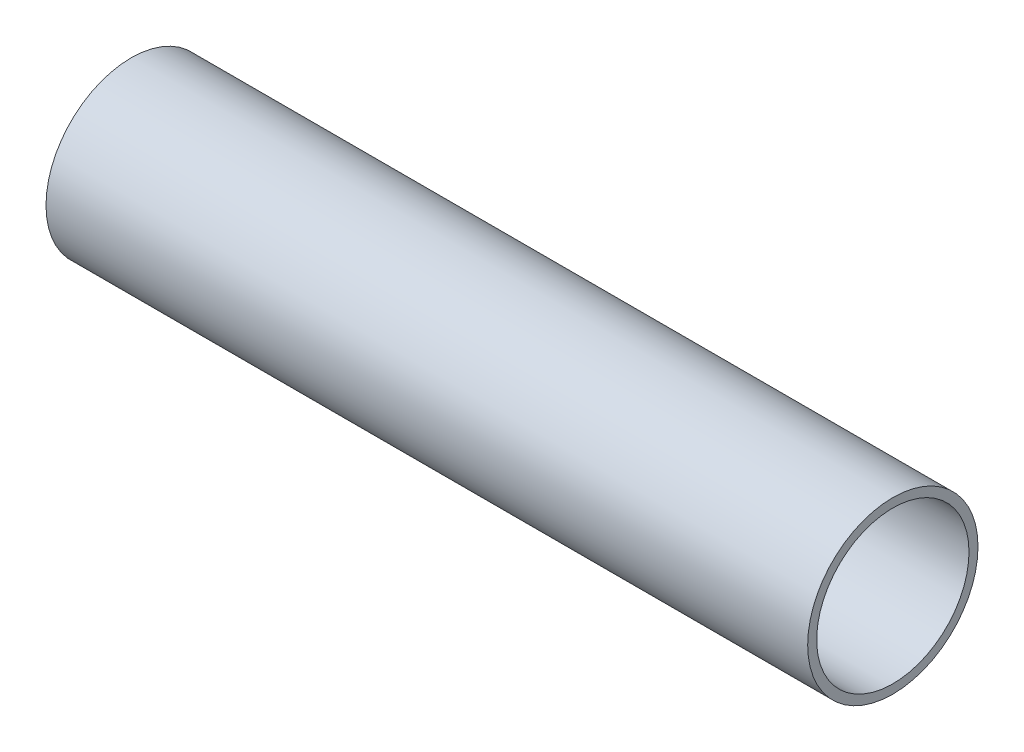
ISO-10303-21;
HEADER;
FILE_DESCRIPTION(('STEP AP214'),'2;1');
FILE_NAME('part.step','',(''),(''),'','','');
FILE_SCHEMA(('AUTOMOTIVE_DESIGN { 1 0 10303 214 1 1 1 1 }'));
ENDSEC;
DATA;
#1=APPLICATION_CONTEXT('core data for automotive mechanical design processes');
#2=APPLICATION_PROTOCOL_DEFINITION('international standard','automotive_design',2000,#1);
#3=PRODUCT_CONTEXT('',#1,'mechanical');
#4=PRODUCT('Part','Part','',(#3));
#5=PRODUCT_RELATED_PRODUCT_CATEGORY('part','',(#4));
#6=PRODUCT_DEFINITION_FORMATION('','',#4);
#7=PRODUCT_DEFINITION_CONTEXT('part definition',#1,'design');
#8=PRODUCT_DEFINITION('design','',#6,#7);
#9=PRODUCT_DEFINITION_SHAPE('','',#8);
#10=(LENGTH_UNIT() NAMED_UNIT(*) SI_UNIT(.MILLI.,.METRE.));
#11=(NAMED_UNIT(*) PLANE_ANGLE_UNIT() SI_UNIT($,.RADIAN.));
#12=(NAMED_UNIT(*) SI_UNIT($,.STERADIAN.) SOLID_ANGLE_UNIT());
#13=UNCERTAINTY_MEASURE_WITH_UNIT(LENGTH_MEASURE(1.E-05),#10,'distance_accuracy_value','');
#14=(GEOMETRIC_REPRESENTATION_CONTEXT(3) GLOBAL_UNCERTAINTY_ASSIGNED_CONTEXT((#13)) GLOBAL_UNIT_ASSIGNED_CONTEXT((#10,
#11,#12)) REPRESENTATION_CONTEXT('',''));
#15=CARTESIAN_POINT('',(0.,0.,0.));
#16=DIRECTION('',(0.,0.,1.));
#17=DIRECTION('',(1.,0.,0.));
#18=AXIS2_PLACEMENT_3D('',#15,#16,#17);
#19=CARTESIAN_POINT('',(508.,0.,0.));
#20=DIRECTION('',(1.,0.,0.));
#21=DIRECTION('',(0.,0.,-1.));
#22=AXIS2_PLACEMENT_3D('',#19,#20,#21);
#23=PLANE('',#22);
#24=CARTESIAN_POINT('',(508.,0.,0.));
#25=DIRECTION('',(1.,0.,0.));
#26=DIRECTION('',(0.,0.,-1.));
#27=AXIS2_PLACEMENT_3D('',#24,#25,#26);
#28=CIRCLE('',#27,56.8);
#29=CARTESIAN_POINT('',(508.,0.,-56.8));
#30=VERTEX_POINT('',#29);
#31=EDGE_CURVE('E10',#30,#30,#28,.T.);
#32=ORIENTED_EDGE('',*,*,#31,.T.);
#33=EDGE_LOOP('',(#32));
#34=FACE_BOUND('',#33,.T.);
#35=CARTESIAN_POINT('',(508.,0.,0.));
#36=DIRECTION('',(1.,0.,0.));
#37=DIRECTION('',(0.,0.,-1.));
#38=AXIS2_PLACEMENT_3D('',#35,#36,#37);
#39=CIRCLE('',#38,50.8);
#40=CARTESIAN_POINT('',(508.,0.,-50.8));
#41=VERTEX_POINT('',#40);
#42=EDGE_CURVE('E43',#41,#41,#39,.T.);
#43=ORIENTED_EDGE('',*,*,#42,.F.);
#44=EDGE_LOOP('',(#43));
#45=FACE_BOUND('',#44,.T.);
#46=ADVANCED_FACE('F32',(#34,#45),#23,.T.);
#47=CARTESIAN_POINT('',(0.,0.,0.));
#48=DIRECTION('',(1.,0.,0.));
#49=DIRECTION('',(0.,0.,-1.));
#50=AXIS2_PLACEMENT_3D('',#47,#48,#49);
#51=PLANE('',#50);
#52=CARTESIAN_POINT('',(0.,0.,0.));
#53=DIRECTION('',(1.,0.,0.));
#54=DIRECTION('',(0.,0.,-1.));
#55=AXIS2_PLACEMENT_3D('',#52,#53,#54);
#56=CIRCLE('',#55,56.8);
#57=CARTESIAN_POINT('',(0.,0.,-56.8));
#58=VERTEX_POINT('',#57);
#59=EDGE_CURVE('E36',#58,#58,#56,.T.);
#60=ORIENTED_EDGE('',*,*,#59,.F.);
#61=EDGE_LOOP('',(#60));
#62=FACE_BOUND('',#61,.T.);
#63=CARTESIAN_POINT('',(0.,0.,0.));
#64=DIRECTION('',(1.,0.,0.));
#65=DIRECTION('',(0.,0.,-1.));
#66=AXIS2_PLACEMENT_3D('',#63,#64,#65);
#67=CIRCLE('',#66,50.8);
#68=CARTESIAN_POINT('',(0.,0.,-50.8));
#69=VERTEX_POINT('',#68);
#70=EDGE_CURVE('E45',#69,#69,#67,.T.);
#71=ORIENTED_EDGE('',*,*,#70,.T.);
#72=EDGE_LOOP('',(#71));
#73=FACE_BOUND('',#72,.T.);
#74=ADVANCED_FACE('F55',(#62,#73),#51,.F.);
#75=CARTESIAN_POINT('',(508.,0.,0.));
#76=DIRECTION('',(-1.,0.,0.));
#77=DIRECTION('',(0.,0.,1.));
#78=AXIS2_PLACEMENT_3D('',#75,#76,#77);
#79=CYLINDRICAL_SURFACE('',#78,56.8);
#80=ORIENTED_EDGE('',*,*,#31,.F.);
#81=EDGE_LOOP('',(#80));
#82=FACE_BOUND('',#81,.T.);
#83=ORIENTED_EDGE('',*,*,#59,.T.);
#84=EDGE_LOOP('',(#83));
#85=FACE_BOUND('',#84,.T.);
#86=ADVANCED_FACE('F34',(#82,#85),#79,.T.);
#87=CARTESIAN_POINT('',(508.,0.,0.));
#88=DIRECTION('',(-1.,0.,0.));
#89=DIRECTION('',(0.,0.,1.));
#90=AXIS2_PLACEMENT_3D('',#87,#88,#89);
#91=CYLINDRICAL_SURFACE('',#90,50.8);
#92=ORIENTED_EDGE('',*,*,#42,.T.);
#93=EDGE_LOOP('',(#92));
#94=FACE_BOUND('',#93,.T.);
#95=ORIENTED_EDGE('',*,*,#70,.F.);
#96=EDGE_LOOP('',(#95));
#97=FACE_BOUND('',#96,.T.);
#98=ADVANCED_FACE('F51',(#94,#97),#91,.F.);
#99=CLOSED_SHELL('',(#46,#74,#86,#98));
#100=MANIFOLD_SOLID_BREP('B2',#99);
#101=ADVANCED_BREP_SHAPE_REPRESENTATION('',(#18,#100),#14);
#102=SHAPE_DEFINITION_REPRESENTATION(#9,#101);
ENDSEC;
END-ISO-10303-21;
